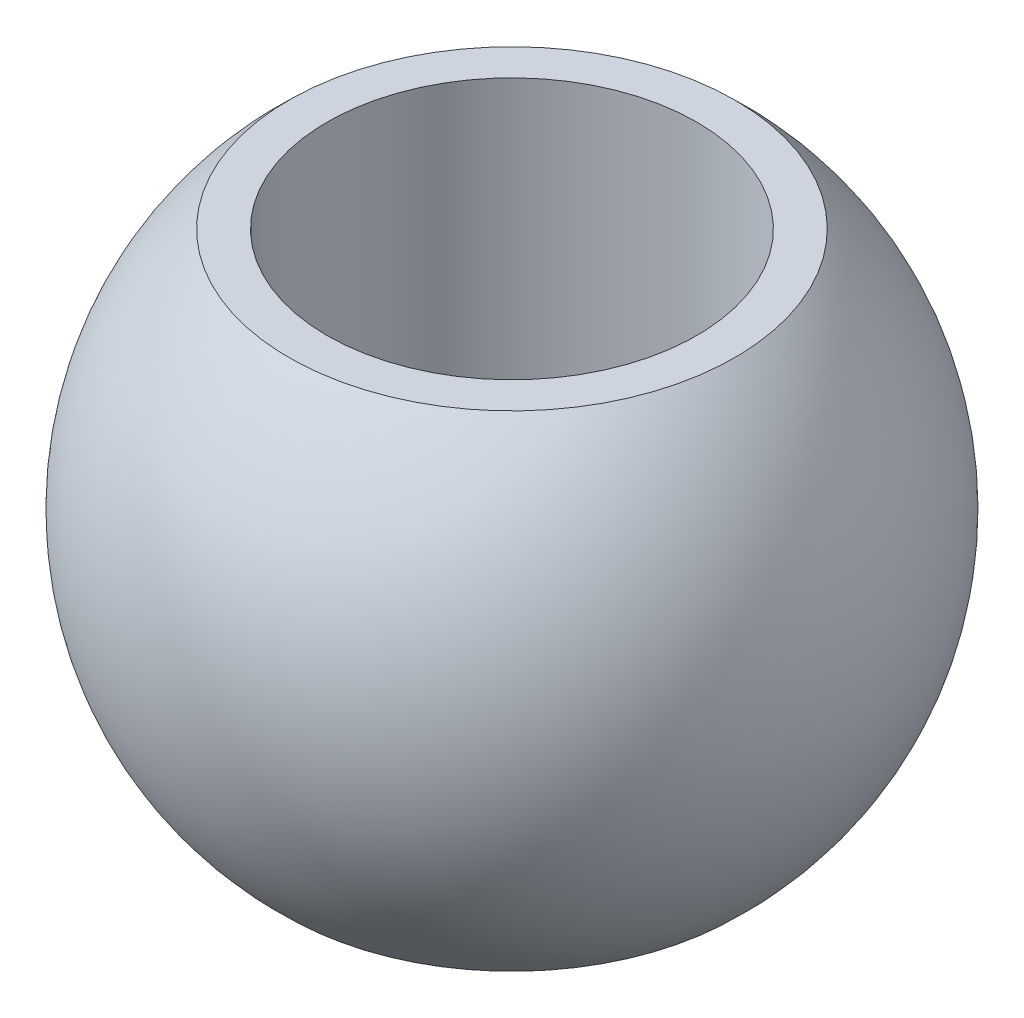
ISO-10303-21;
HEADER;
FILE_DESCRIPTION(('STEP AP214'),'2;1');
FILE_NAME('part.step','',(''),(''),'','','');
FILE_SCHEMA(('AUTOMOTIVE_DESIGN { 1 0 10303 214 1 1 1 1 }'));
ENDSEC;
DATA;
#1=APPLICATION_CONTEXT('core data for automotive mechanical design processes');
#2=APPLICATION_PROTOCOL_DEFINITION('international standard','automotive_design',2000,#1);
#3=PRODUCT_CONTEXT('',#1,'mechanical');
#4=PRODUCT('Part','Part','',(#3));
#5=PRODUCT_RELATED_PRODUCT_CATEGORY('part','',(#4));
#6=PRODUCT_DEFINITION_FORMATION('','',#4);
#7=PRODUCT_DEFINITION_CONTEXT('part definition',#1,'design');
#8=PRODUCT_DEFINITION('design','',#6,#7);
#9=PRODUCT_DEFINITION_SHAPE('','',#8);
#10=(LENGTH_UNIT() NAMED_UNIT(*) SI_UNIT(.MILLI.,.METRE.));
#11=(NAMED_UNIT(*) PLANE_ANGLE_UNIT() SI_UNIT($,.RADIAN.));
#12=(NAMED_UNIT(*) SI_UNIT($,.STERADIAN.) SOLID_ANGLE_UNIT());
#13=UNCERTAINTY_MEASURE_WITH_UNIT(LENGTH_MEASURE(1.E-05),#10,'distance_accuracy_value','');
#14=(GEOMETRIC_REPRESENTATION_CONTEXT(3) GLOBAL_UNCERTAINTY_ASSIGNED_CONTEXT((#13)) GLOBAL_UNIT_ASSIGNED_CONTEXT((#10,
#11,#12)) REPRESENTATION_CONTEXT('',''));
#15=CARTESIAN_POINT('',(0.,0.,0.));
#16=DIRECTION('',(0.,0.,1.));
#17=DIRECTION('',(1.,0.,0.));
#18=AXIS2_PLACEMENT_3D('',#15,#16,#17);
#19=CARTESIAN_POINT('',(8.,-10.5,0.));
#20=DIRECTION('',(0.,-1.,0.));
#21=DIRECTION('',(0.,0.,-1.));
#22=AXIS2_PLACEMENT_3D('',#19,#20,#21);
#23=PLANE('',#22);
#24=CARTESIAN_POINT('',(0.,-10.5,0.));
#25=DIRECTION('',(0.,-1.,0.));
#26=DIRECTION('',(0.,0.,-1.));
#27=AXIS2_PLACEMENT_3D('',#24,#25,#26);
#28=CIRCLE('',#27,9.64870975830447);
#29=CARTESIAN_POINT('',(0.,-10.5,-9.64870975830447));
#30=VERTEX_POINT('',#29);
#31=EDGE_CURVE('E10',#30,#30,#28,.T.);
#32=ORIENTED_EDGE('',*,*,#31,.T.);
#33=EDGE_LOOP('',(#32));
#34=FACE_BOUND('',#33,.T.);
#35=CARTESIAN_POINT('',(0.,-10.5,0.));
#36=DIRECTION('',(0.,-1.,0.));
#37=DIRECTION('',(0.,0.,-1.));
#38=AXIS2_PLACEMENT_3D('',#35,#36,#37);
#39=CIRCLE('',#38,8.);
#40=CARTESIAN_POINT('',(0.,-10.5,-8.));
#41=VERTEX_POINT('',#40);
#42=EDGE_CURVE('E44',#41,#41,#39,.T.);
#43=ORIENTED_EDGE('',*,*,#42,.F.);
#44=EDGE_LOOP('',(#43));
#45=FACE_BOUND('',#44,.T.);
#46=ADVANCED_FACE('F30',(#34,#45),#23,.T.);
#47=CARTESIAN_POINT('',(0.,0.,0.));
#48=DIRECTION('',(0.,-1.,0.));
#49=DIRECTION('',(1.,0.,0.));
#50=AXIS2_PLACEMENT_3D('',#47,#48,#49);
#51=SPHERICAL_SURFACE('',#50,14.26);
#52=CARTESIAN_POINT('',(0.,10.5,0.));
#53=DIRECTION('',(0.,-1.,0.));
#54=DIRECTION('',(0.,0.,-1.));
#55=AXIS2_PLACEMENT_3D('',#52,#53,#54);
#56=CIRCLE('',#55,9.64870975830448);
#57=CARTESIAN_POINT('',(0.,10.5,-9.64870975830448));
#58=VERTEX_POINT('',#57);
#59=EDGE_CURVE('E36',#58,#58,#56,.T.);
#60=ORIENTED_EDGE('',*,*,#59,.T.);
#61=EDGE_LOOP('',(#60));
#62=FACE_BOUND('',#61,.T.);
#63=ORIENTED_EDGE('',*,*,#31,.F.);
#64=EDGE_LOOP('',(#63));
#65=FACE_BOUND('',#64,.T.);
#66=ADVANCED_FACE('F54',(#62,#65),#51,.T.);
#67=CARTESIAN_POINT('',(8.,10.5,0.));
#68=DIRECTION('',(0.,1.,0.));
#69=DIRECTION('',(0.,0.,1.));
#70=AXIS2_PLACEMENT_3D('',#67,#68,#69);
#71=PLANE('',#70);
#72=CARTESIAN_POINT('',(0.,10.5,0.));
#73=DIRECTION('',(0.,-1.,0.));
#74=DIRECTION('',(0.,0.,-1.));
#75=AXIS2_PLACEMENT_3D('',#72,#73,#74);
#76=CIRCLE('',#75,8.);
#77=CARTESIAN_POINT('',(0.,10.5,-8.));
#78=VERTEX_POINT('',#77);
#79=EDGE_CURVE('E40',#78,#78,#76,.T.);
#80=ORIENTED_EDGE('',*,*,#79,.T.);
#81=EDGE_LOOP('',(#80));
#82=FACE_BOUND('',#81,.T.);
#83=ORIENTED_EDGE('',*,*,#59,.F.);
#84=EDGE_LOOP('',(#83));
#85=FACE_BOUND('',#84,.T.);
#86=ADVANCED_FACE('F58',(#82,#85),#71,.T.);
#87=CARTESIAN_POINT('',(0.,-11.1,0.));
#88=DIRECTION('',(0.,-1.,0.));
#89=DIRECTION('',(0.,0.,-1.));
#90=AXIS2_PLACEMENT_3D('',#87,#88,#89);
#91=CYLINDRICAL_SURFACE('',#90,8.);
#92=ORIENTED_EDGE('',*,*,#42,.T.);
#93=EDGE_LOOP('',(#92));
#94=FACE_BOUND('',#93,.T.);
#95=ORIENTED_EDGE('',*,*,#79,.F.);
#96=EDGE_LOOP('',(#95));
#97=FACE_BOUND('',#96,.T.);
#98=ADVANCED_FACE('F50',(#94,#97),#91,.F.);
#99=CLOSED_SHELL('',(#46,#66,#86,#98));
#100=MANIFOLD_SOLID_BREP('B2',#99);
#101=ADVANCED_BREP_SHAPE_REPRESENTATION('',(#18,#100),#14);
#102=SHAPE_DEFINITION_REPRESENTATION(#9,#101);
ENDSEC;
END-ISO-10303-21;
